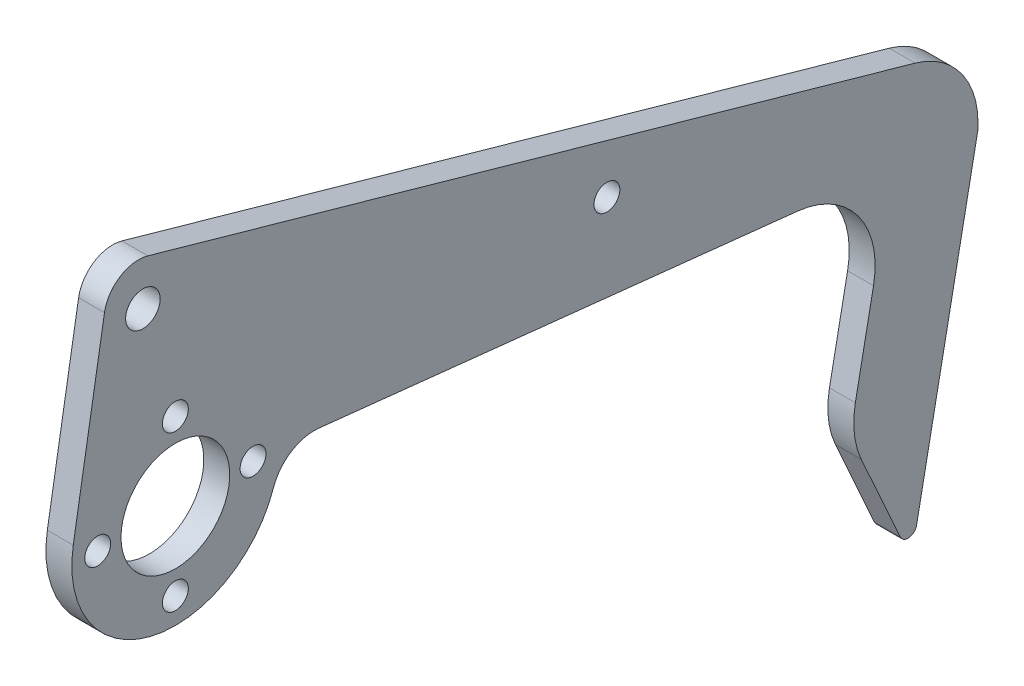
ISO-10303-21;
HEADER;
FILE_DESCRIPTION(('STEP AP214'),'2;1');
FILE_NAME('part.step','',(''),(''),'','','');
FILE_SCHEMA(('AUTOMOTIVE_DESIGN { 1 0 10303 214 1 1 1 1 }'));
ENDSEC;
DATA;
#1=APPLICATION_CONTEXT('core data for automotive mechanical design processes');
#2=APPLICATION_PROTOCOL_DEFINITION('international standard','automotive_design',2000,#1);
#3=PRODUCT_CONTEXT('',#1,'mechanical');
#4=PRODUCT('Part','Part','',(#3));
#5=PRODUCT_RELATED_PRODUCT_CATEGORY('part','',(#4));
#6=PRODUCT_DEFINITION_FORMATION('','',#4);
#7=PRODUCT_DEFINITION_CONTEXT('part definition',#1,'design');
#8=PRODUCT_DEFINITION('design','',#6,#7);
#9=PRODUCT_DEFINITION_SHAPE('','',#8);
#10=(LENGTH_UNIT() NAMED_UNIT(*) SI_UNIT(.MILLI.,.METRE.));
#11=(NAMED_UNIT(*) PLANE_ANGLE_UNIT() SI_UNIT($,.RADIAN.));
#12=(NAMED_UNIT(*) SI_UNIT($,.STERADIAN.) SOLID_ANGLE_UNIT());
#13=UNCERTAINTY_MEASURE_WITH_UNIT(LENGTH_MEASURE(1.E-05),#10,'distance_accuracy_value','');
#14=(GEOMETRIC_REPRESENTATION_CONTEXT(3) GLOBAL_UNCERTAINTY_ASSIGNED_CONTEXT((#13)) GLOBAL_UNIT_ASSIGNED_CONTEXT((#10,
#11,#12)) REPRESENTATION_CONTEXT('',''));
#15=CARTESIAN_POINT('',(0.,0.,0.));
#16=DIRECTION('',(0.,0.,1.));
#17=DIRECTION('',(1.,0.,0.));
#18=AXIS2_PLACEMENT_3D('',#15,#16,#17);
#19=CARTESIAN_POINT('',(3.,0.,0.));
#20=DIRECTION('',(-1.,0.,0.));
#21=DIRECTION('',(0.,0.,-1.));
#22=AXIS2_PLACEMENT_3D('',#19,#20,#21);
#23=CYLINDRICAL_SURFACE('',#22,12.);
#24=CARTESIAN_POINT('',(3.,0.,0.));
#25=DIRECTION('',(-1.,0.,0.));
#26=DIRECTION('',(0.,0.,1.));
#27=AXIS2_PLACEMENT_3D('',#24,#25,#26);
#28=CIRCLE('',#27,12.);
#29=CARTESIAN_POINT('',(3.,-3.86044776965129,-11.3620835685095));
#30=VERTEX_POINT('',#29);
#31=CARTESIAN_POINT('',(3.,1.99138832062666,11.8336119826734));
#32=VERTEX_POINT('',#31);
#33=EDGE_CURVE('E205',#30,#32,#28,.T.);
#34=ORIENTED_EDGE('',*,*,#33,.T.);
#35=DIRECTION('',(1.,0.,0.));
#36=VECTOR('',#35,1.);
#37=CARTESIAN_POINT('',(0.,1.99138832062666,11.8336119826734));
#38=LINE('',#37,#36);
#39=CARTESIAN_POINT('',(0.,1.99138832062666,11.8336119826734));
#40=VERTEX_POINT('',#39);
#41=EDGE_CURVE('E203',#40,#32,#38,.T.);
#42=ORIENTED_EDGE('',*,*,#41,.F.);
#43=CARTESIAN_POINT('',(0.,0.,0.));
#44=DIRECTION('',(-1.,0.,0.));
#45=DIRECTION('',(0.,0.,1.));
#46=AXIS2_PLACEMENT_3D('',#43,#44,#45);
#47=CIRCLE('',#46,12.);
#48=CARTESIAN_POINT('',(0.,-3.86044776965129,-11.3620835685095));
#49=VERTEX_POINT('',#48);
#50=EDGE_CURVE('E201',#49,#40,#47,.T.);
#51=ORIENTED_EDGE('',*,*,#50,.F.);
#52=DIRECTION('',(-1.,0.,0.));
#53=VECTOR('',#52,1.);
#54=CARTESIAN_POINT('',(3.,-3.86044776965129,-11.3620835685095));
#55=LINE('',#54,#53);
#56=EDGE_CURVE('E195',#30,#49,#55,.T.);
#57=ORIENTED_EDGE('',*,*,#56,.F.);
#58=EDGE_LOOP('',(#34,#42,#51,#57));
#59=FACE_BOUND('',#58,.T.);
#60=ADVANCED_FACE('F39',(#59),#23,.T.);
#61=CARTESIAN_POINT('',(3.,0.,0.));
#62=DIRECTION('',(1.,0.,0.));
#63=DIRECTION('',(0.,0.,1.));
#64=AXIS2_PLACEMENT_3D('',#61,#62,#63);
#65=PLANE('',#64);
#66=DIRECTION('',(0.,0.981180262311398,-0.19309400003764));
#67=VECTOR('',#66,1.);
#68=CARTESIAN_POINT('',(3.,-8.70416584597603,-93.));
#69=LINE('',#68,#67);
#70=CARTESIAN_POINT('',(3.,-44.8725053736254,-85.8821546637504));
#71=VERTEX_POINT('',#70);
#72=CARTESIAN_POINT('',(3.,-8.70416584597603,-93.));
#73=VERTEX_POINT('',#72);
#74=EDGE_CURVE('E248',#71,#73,#69,.T.);
#75=ORIENTED_EDGE('',*,*,#74,.T.);
#76=DIRECTION('',(0.,1.,0.));
#77=VECTOR('',#76,1.);
#78=CARTESIAN_POINT('',(3.,-8.70416584597603,-93.));
#79=LINE('',#78,#77);
#80=CARTESIAN_POINT('',(3.,-8.03590102239973,-93.));
#81=VERTEX_POINT('',#80);
#82=EDGE_CURVE('E163',#73,#81,#79,.T.);
#83=ORIENTED_EDGE('',*,*,#82,.T.);
#84=CARTESIAN_POINT('',(3.,-8.03590102239973,-83.));
#85=DIRECTION('',(-1.,0.,0.));
#86=DIRECTION('',(0.,0.,1.));
#87=AXIS2_PLACEMENT_3D('',#84,#85,#86);
#88=CIRCLE('',#87,10.);
#89=CARTESIAN_POINT('',(3.,1.58758729883579,-85.7181744850255));
#90=VERTEX_POINT('',#89);
#91=EDGE_CURVE('E143',#90,#81,#88,.T.);
#92=ORIENTED_EDGE('',*,*,#91,.F.);
#93=DIRECTION('',(0.,0.271817448502551,0.962348832123551));
#94=VECTOR('',#93,1.);
#95=CARTESIAN_POINT('',(3.,23.892723580228,-6.7485499483835));
#96=LINE('',#95,#94);
#97=CARTESIAN_POINT('',(3.,26.6971591930867,3.18033928101759));
#98=VERTEX_POINT('',#97);
#99=EDGE_CURVE('E151',#90,#98,#96,.T.);
#100=ORIENTED_EDGE('',*,*,#99,.T.);
#101=CARTESIAN_POINT('',(3.,22.8477638645925,4.2676090750278));
#102=DIRECTION('',(-1.,0.,0.));
#103=DIRECTION('',(0.,0.,1.));
#104=AXIS2_PLACEMENT_3D('',#101,#102,#103);
#105=CIRCLE('',#104,4.);
#106=CARTESIAN_POINT('',(3.,23.5115599714681,8.2121464025856));
#107=VERTEX_POINT('',#106);
#108=EDGE_CURVE('E271',#107,#98,#105,.T.);
#109=ORIENTED_EDGE('',*,*,#108,.F.);
#110=DIRECTION('',(0.,0.986134331889451,-0.165949026718888));
#111=VECTOR('',#110,1.);
#112=CARTESIAN_POINT('',(3.,1.99138832062666,11.8336119826734));
#113=LINE('',#112,#111);
#114=EDGE_CURVE('E265',#32,#107,#113,.T.);
#115=ORIENTED_EDGE('',*,*,#114,.F.);
#116=ORIENTED_EDGE('',*,*,#33,.F.);
#117=CARTESIAN_POINT('',(3.,-5.46896767367267,-16.0962850553885));
#118=DIRECTION('',(-1.,0.,0.));
#119=DIRECTION('',(0.,0.,1.));
#120=AXIS2_PLACEMENT_3D('',#117,#118,#119);
#121=CIRCLE('',#120,5.);
#122=CARTESIAN_POINT('',(3.,-0.497588542771267,-16.6305036780872));
#123=VERTEX_POINT('',#122);
#124=EDGE_CURVE('E47',#123,#30,#121,.F.);
#125=ORIENTED_EDGE('',*,*,#124,.F.);
#126=DIRECTION('',(0.,-0.106843724539728,-0.99427582618028));
#127=VECTOR('',#126,1.);
#128=CARTESIAN_POINT('',(3.,1.274785589867,-0.136986977682256));
#129=LINE('',#128,#127);
#130=CARTESIAN_POINT('',(3.,-6.46358282116851,-72.1493833848179));
#131=VERTEX_POINT('',#130);
#132=EDGE_CURVE('E257',#123,#131,#129,.T.);
#133=ORIENTED_EDGE('',*,*,#132,.T.);
#134=CARTESIAN_POINT('',(3.,-16.4063410829713,-71.0809461394205));
#135=DIRECTION('',(-1.,0.,0.));
#136=DIRECTION('',(0.,0.,1.));
#137=AXIS2_PLACEMENT_3D('',#134,#135,#136);
#138=CIRCLE('',#137,10.);
#139=CARTESIAN_POINT('',(3.,-18.3372810833477,-80.8927487625345));
#140=VERTEX_POINT('',#139);
#141=EDGE_CURVE('E180',#140,#131,#138,.F.);
#142=ORIENTED_EDGE('',*,*,#141,.F.);
#143=DIRECTION('',(0.,-0.981180262311398,0.19309400003764));
#144=VECTOR('',#143,1.);
#145=CARTESIAN_POINT('',(3.,-32.1590840277146,-78.172649999059));
#146=LINE('',#145,#144);
#147=CARTESIAN_POINT('',(3.,-29.0322407200414,-78.7880055101322));
#148=VERTEX_POINT('',#147);
#149=EDGE_CURVE('E240',#140,#148,#146,.T.);
#150=ORIENTED_EDGE('',*,*,#149,.T.);
#151=CARTESIAN_POINT('',(3.,-30.9631807204178,-88.5998081332462));
#152=DIRECTION('',(-1.,0.,0.));
#153=DIRECTION('',(0.,0.,1.));
#154=AXIS2_PLACEMENT_3D('',#151,#152,#153);
#155=CIRCLE('',#154,10.);
#156=CARTESIAN_POINT('',(3.,-35.0654148019241,-79.479957501765));
#157=VERTEX_POINT('',#156);
#158=EDGE_CURVE('E164',#157,#148,#155,.T.);
#159=ORIENTED_EDGE('',*,*,#158,.F.);
#160=DIRECTION('',(0.,-0.911985063148122,-0.410223408150628));
#161=VECTOR('',#160,1.);
#162=CARTESIAN_POINT('',(3.,-47.951376338432,-85.2762399984944));
#163=LINE('',#162,#161);
#164=CARTESIAN_POINT('',(3.,-45.0896347817384,-83.9889893382909));
#165=VERTEX_POINT('',#164);
#166=EDGE_CURVE('E247',#157,#165,#163,.T.);
#167=ORIENTED_EDGE('',*,*,#166,.T.);
#168=CARTESIAN_POINT('',(3.,-44.6794113735878,-84.9009744014391));
#169=DIRECTION('',(-1.,0.,0.));
#170=DIRECTION('',(0.,0.,1.));
#171=AXIS2_PLACEMENT_3D('',#168,#169,#170);
#172=CIRCLE('',#171,1.);
#173=EDGE_CURVE('E190',#71,#165,#172,.T.);
#174=ORIENTED_EDGE('',*,*,#173,.F.);
#175=EDGE_LOOP('',(#75,#83,#92,#100,#109,#115,#116,#125,#133,#142,#150,#159,#167,#174));
#176=FACE_BOUND('',#175,.T.);
#177=CARTESIAN_POINT('',(3.,6.,-50.));
#178=DIRECTION('',(1.,0.,0.));
#179=DIRECTION('',(0.,0.,-1.));
#180=AXIS2_PLACEMENT_3D('',#177,#178,#179);
#181=CIRCLE('',#180,1.5);
#182=CARTESIAN_POINT('',(3.,6.,-51.5));
#183=VERTEX_POINT('',#182);
#184=EDGE_CURVE('E281',#183,#183,#181,.T.);
#185=ORIENTED_EDGE('',*,*,#184,.F.);
#186=EDGE_LOOP('',(#185));
#187=FACE_BOUND('',#186,.T.);
#188=CARTESIAN_POINT('',(3.,-9.,0.));
#189=DIRECTION('',(-1.,0.,0.));
#190=DIRECTION('',(0.,0.,1.));
#191=AXIS2_PLACEMENT_3D('',#188,#189,#190);
#192=CIRCLE('',#191,1.5);
#193=CARTESIAN_POINT('',(3.,-9.,1.5));
#194=VERTEX_POINT('',#193);
#195=EDGE_CURVE('E293',#194,#194,#192,.T.);
#196=ORIENTED_EDGE('',*,*,#195,.T.);
#197=EDGE_LOOP('',(#196));
#198=FACE_BOUND('',#197,.T.);
#199=CARTESIAN_POINT('',(3.,0.,0.));
#200=DIRECTION('',(-1.,0.,0.));
#201=DIRECTION('',(0.,0.,1.));
#202=AXIS2_PLACEMENT_3D('',#199,#200,#201);
#203=CIRCLE('',#202,6.3);
#204=CARTESIAN_POINT('',(3.,0.,6.3));
#205=VERTEX_POINT('',#204);
#206=EDGE_CURVE('E305',#205,#205,#203,.T.);
#207=ORIENTED_EDGE('',*,*,#206,.T.);
#208=EDGE_LOOP('',(#207));
#209=FACE_BOUND('',#208,.T.);
#210=CARTESIAN_POINT('',(3.,9.,0.));
#211=DIRECTION('',(-1.,0.,0.));
#212=DIRECTION('',(0.,0.,1.));
#213=AXIS2_PLACEMENT_3D('',#210,#211,#212);
#214=CIRCLE('',#213,1.5);
#215=CARTESIAN_POINT('',(3.,9.,1.5));
#216=VERTEX_POINT('',#215);
#217=EDGE_CURVE('E206',#216,#216,#214,.T.);
#218=ORIENTED_EDGE('',*,*,#217,.T.);
#219=EDGE_LOOP('',(#218));
#220=FACE_BOUND('',#219,.T.);
#221=CARTESIAN_POINT('',(3.,0.,9.));
#222=DIRECTION('',(-1.,0.,0.));
#223=DIRECTION('',(0.,0.,1.));
#224=AXIS2_PLACEMENT_3D('',#221,#222,#223);
#225=CIRCLE('',#224,1.5);
#226=CARTESIAN_POINT('',(3.,0.,10.5));
#227=VERTEX_POINT('',#226);
#228=EDGE_CURVE('E299',#227,#227,#225,.T.);
#229=ORIENTED_EDGE('',*,*,#228,.T.);
#230=EDGE_LOOP('',(#229));
#231=FACE_BOUND('',#230,.T.);
#232=CARTESIAN_POINT('',(3.,0.,-9.));
#233=DIRECTION('',(-1.,0.,0.));
#234=DIRECTION('',(0.,0.,1.));
#235=AXIS2_PLACEMENT_3D('',#232,#233,#234);
#236=CIRCLE('',#235,1.5);
#237=CARTESIAN_POINT('',(3.,0.,-7.5));
#238=VERTEX_POINT('',#237);
#239=EDGE_CURVE('E287',#238,#238,#236,.T.);
#240=ORIENTED_EDGE('',*,*,#239,.T.);
#241=EDGE_LOOP('',(#240));
#242=FACE_BOUND('',#241,.T.);
#243=CARTESIAN_POINT('',(3.,21.6761722371468,3.76079209017824));
#244=DIRECTION('',(-1.,0.,0.));
#245=DIRECTION('',(0.,0.,1.));
#246=AXIS2_PLACEMENT_3D('',#243,#244,#245);
#247=CIRCLE('',#246,2.);
#248=CARTESIAN_POINT('',(3.,21.6761722371468,5.76079209017824));
#249=VERTEX_POINT('',#248);
#250=EDGE_CURVE('E261',#249,#249,#247,.T.);
#251=ORIENTED_EDGE('',*,*,#250,.T.);
#252=EDGE_LOOP('',(#251));
#253=FACE_BOUND('',#252,.T.);
#254=ADVANCED_FACE('F160',(#176,#187,#198,#209,#220,#231,#242,#253),#65,.T.);
#255=CARTESIAN_POINT('',(0.,0.,0.));
#256=DIRECTION('',(1.,0.,0.));
#257=DIRECTION('',(0.,0.,1.));
#258=AXIS2_PLACEMENT_3D('',#255,#256,#257);
#259=PLANE('',#258);
#260=DIRECTION('',(0.,-0.271817448502551,-0.962348832123551));
#261=VECTOR('',#260,1.);
#262=CARTESIAN_POINT('',(0.,23.892723580228,-6.7485499483835));
#263=LINE('',#262,#261);
#264=CARTESIAN_POINT('',(0.,26.6971591930867,3.1803392810176));
#265=VERTEX_POINT('',#264);
#266=CARTESIAN_POINT('',(0.,1.58758729883578,-85.7181744850255));
#267=VERTEX_POINT('',#266);
#268=EDGE_CURVE('E242',#265,#267,#263,.T.);
#269=ORIENTED_EDGE('',*,*,#268,.T.);
#270=CARTESIAN_POINT('',(0.,-8.03590102239973,-83.));
#271=DIRECTION('',(-1.,0.,0.));
#272=DIRECTION('',(0.,0.,1.));
#273=AXIS2_PLACEMENT_3D('',#270,#271,#272);
#274=CIRCLE('',#273,10.);
#275=CARTESIAN_POINT('',(0.,-8.03590102239973,-93.));
#276=VERTEX_POINT('',#275);
#277=EDGE_CURVE('E146',#276,#267,#274,.F.);
#278=ORIENTED_EDGE('',*,*,#277,.F.);
#279=DIRECTION('',(0.,1.,0.));
#280=VECTOR('',#279,1.);
#281=CARTESIAN_POINT('',(0.,-8.70416584597603,-93.));
#282=LINE('',#281,#280);
#283=CARTESIAN_POINT('',(0.,-8.70416584597603,-93.));
#284=VERTEX_POINT('',#283);
#285=EDGE_CURVE('E250',#284,#276,#282,.T.);
#286=ORIENTED_EDGE('',*,*,#285,.F.);
#287=DIRECTION('',(0.,0.981180262311398,-0.19309400003764));
#288=VECTOR('',#287,1.);
#289=CARTESIAN_POINT('',(0.,-8.70416584597603,-93.));
#290=LINE('',#289,#288);
#291=CARTESIAN_POINT('',(0.,-44.8725053736254,-85.8821546637504));
#292=VERTEX_POINT('',#291);
#293=EDGE_CURVE('E236',#292,#284,#290,.T.);
#294=ORIENTED_EDGE('',*,*,#293,.F.);
#295=CARTESIAN_POINT('',(0.,-44.6794113735878,-84.9009744014391));
#296=DIRECTION('',(-1.,0.,0.));
#297=DIRECTION('',(0.,0.,1.));
#298=AXIS2_PLACEMENT_3D('',#295,#296,#297);
#299=CIRCLE('',#298,1.);
#300=CARTESIAN_POINT('',(0.,-45.0896347817384,-83.9889893382909));
#301=VERTEX_POINT('',#300);
#302=EDGE_CURVE('E185',#301,#292,#299,.F.);
#303=ORIENTED_EDGE('',*,*,#302,.F.);
#304=DIRECTION('',(0.,-0.911985063148122,-0.410223408150628));
#305=VECTOR('',#304,1.);
#306=CARTESIAN_POINT('',(0.,-47.951376338432,-85.2762399984944));
#307=LINE('',#306,#305);
#308=CARTESIAN_POINT('',(0.,-35.0654148019241,-79.479957501765));
#309=VERTEX_POINT('',#308);
#310=EDGE_CURVE('E231',#309,#301,#307,.T.);
#311=ORIENTED_EDGE('',*,*,#310,.F.);
#312=CARTESIAN_POINT('',(0.,-30.9631807204178,-88.5998081332462));
#313=DIRECTION('',(-1.,0.,0.));
#314=DIRECTION('',(0.,0.,1.));
#315=AXIS2_PLACEMENT_3D('',#312,#313,#314);
#316=CIRCLE('',#315,10.);
#317=CARTESIAN_POINT('',(0.,-29.0322407200414,-78.7880055101322));
#318=VERTEX_POINT('',#317);
#319=EDGE_CURVE('E170',#318,#309,#316,.F.);
#320=ORIENTED_EDGE('',*,*,#319,.F.);
#321=DIRECTION('',(0.,-0.981180262311398,0.19309400003764));
#322=VECTOR('',#321,1.);
#323=CARTESIAN_POINT('',(0.,-32.1590840277146,-78.172649999059));
#324=LINE('',#323,#322);
#325=CARTESIAN_POINT('',(0.,-18.3372810833477,-80.8927487625345));
#326=VERTEX_POINT('',#325);
#327=EDGE_CURVE('E237',#326,#318,#324,.T.);
#328=ORIENTED_EDGE('',*,*,#327,.F.);
#329=CARTESIAN_POINT('',(0.,-16.4063410829713,-71.0809461394205));
#330=DIRECTION('',(-1.,0.,0.));
#331=DIRECTION('',(0.,0.,1.));
#332=AXIS2_PLACEMENT_3D('',#329,#330,#331);
#333=CIRCLE('',#332,10.);
#334=CARTESIAN_POINT('',(0.,-6.46358282116851,-72.1493833848178));
#335=VERTEX_POINT('',#334);
#336=EDGE_CURVE('E177',#335,#326,#333,.T.);
#337=ORIENTED_EDGE('',*,*,#336,.F.);
#338=DIRECTION('',(0.,-0.106843724539728,-0.99427582618028));
#339=VECTOR('',#338,1.);
#340=CARTESIAN_POINT('',(0.,1.274785589867,-0.136986977682256));
#341=LINE('',#340,#339);
#342=CARTESIAN_POINT('',(0.,-0.497588542771267,-16.6305036780872));
#343=VERTEX_POINT('',#342);
#344=EDGE_CURVE('E208',#343,#335,#341,.T.);
#345=ORIENTED_EDGE('',*,*,#344,.F.);
#346=CARTESIAN_POINT('',(0.,-5.46896767367267,-16.0962850553885));
#347=DIRECTION('',(-1.,0.,0.));
#348=DIRECTION('',(0.,0.,1.));
#349=AXIS2_PLACEMENT_3D('',#346,#347,#348);
#350=CIRCLE('',#349,5.);
#351=EDGE_CURVE('E11',#49,#343,#350,.T.);
#352=ORIENTED_EDGE('',*,*,#351,.F.);
#353=ORIENTED_EDGE('',*,*,#50,.T.);
#354=DIRECTION('',(0.,0.986134331889451,-0.165949026718888));
#355=VECTOR('',#354,1.);
#356=CARTESIAN_POINT('',(0.,1.99138832062666,11.8336119826734));
#357=LINE('',#356,#355);
#358=CARTESIAN_POINT('',(0.,23.5115599714681,8.2121464025856));
#359=VERTEX_POINT('',#358);
#360=EDGE_CURVE('E268',#40,#359,#357,.T.);
#361=ORIENTED_EDGE('',*,*,#360,.T.);
#362=CARTESIAN_POINT('',(0.,22.8477638645925,4.2676090750278));
#363=DIRECTION('',(-1.,0.,0.));
#364=DIRECTION('',(0.,0.,1.));
#365=AXIS2_PLACEMENT_3D('',#362,#363,#364);
#366=CIRCLE('',#365,4.);
#367=EDGE_CURVE('E270',#359,#265,#366,.T.);
#368=ORIENTED_EDGE('',*,*,#367,.T.);
#369=EDGE_LOOP('',(#269,#278,#286,#294,#303,#311,#320,#328,#337,#345,#352,#353,#361,#368));
#370=FACE_BOUND('',#369,.T.);
#371=CARTESIAN_POINT('',(0.,6.,-50.));
#372=DIRECTION('',(1.,0.,0.));
#373=DIRECTION('',(0.,0.,-1.));
#374=AXIS2_PLACEMENT_3D('',#371,#372,#373);
#375=CIRCLE('',#374,1.5);
#376=CARTESIAN_POINT('',(0.,6.,-51.5));
#377=VERTEX_POINT('',#376);
#378=EDGE_CURVE('E279',#377,#377,#375,.T.);
#379=ORIENTED_EDGE('',*,*,#378,.T.);
#380=EDGE_LOOP('',(#379));
#381=FACE_BOUND('',#380,.T.);
#382=CARTESIAN_POINT('',(0.,9.,0.));
#383=DIRECTION('',(-1.,0.,0.));
#384=DIRECTION('',(0.,0.,1.));
#385=AXIS2_PLACEMENT_3D('',#382,#383,#384);
#386=CIRCLE('',#385,1.5);
#387=CARTESIAN_POINT('',(0.,9.,1.5));
#388=VERTEX_POINT('',#387);
#389=EDGE_CURVE('E211',#388,#388,#386,.T.);
#390=ORIENTED_EDGE('',*,*,#389,.F.);
#391=EDGE_LOOP('',(#390));
#392=FACE_BOUND('',#391,.T.);
#393=CARTESIAN_POINT('',(0.,0.,0.));
#394=DIRECTION('',(-1.,0.,0.));
#395=DIRECTION('',(0.,0.,1.));
#396=AXIS2_PLACEMENT_3D('',#393,#394,#395);
#397=CIRCLE('',#396,6.3);
#398=CARTESIAN_POINT('',(0.,0.,6.3));
#399=VERTEX_POINT('',#398);
#400=EDGE_CURVE('E302',#399,#399,#397,.T.);
#401=ORIENTED_EDGE('',*,*,#400,.F.);
#402=EDGE_LOOP('',(#401));
#403=FACE_BOUND('',#402,.T.);
#404=CARTESIAN_POINT('',(0.,0.,9.));
#405=DIRECTION('',(-1.,0.,0.));
#406=DIRECTION('',(0.,0.,1.));
#407=AXIS2_PLACEMENT_3D('',#404,#405,#406);
#408=CIRCLE('',#407,1.5);
#409=CARTESIAN_POINT('',(0.,0.,10.5));
#410=VERTEX_POINT('',#409);
#411=EDGE_CURVE('E296',#410,#410,#408,.T.);
#412=ORIENTED_EDGE('',*,*,#411,.F.);
#413=EDGE_LOOP('',(#412));
#414=FACE_BOUND('',#413,.T.);
#415=CARTESIAN_POINT('',(0.,-9.,0.));
#416=DIRECTION('',(-1.,0.,0.));
#417=DIRECTION('',(0.,0.,1.));
#418=AXIS2_PLACEMENT_3D('',#415,#416,#417);
#419=CIRCLE('',#418,1.5);
#420=CARTESIAN_POINT('',(0.,-9.,1.5));
#421=VERTEX_POINT('',#420);
#422=EDGE_CURVE('E290',#421,#421,#419,.T.);
#423=ORIENTED_EDGE('',*,*,#422,.F.);
#424=EDGE_LOOP('',(#423));
#425=FACE_BOUND('',#424,.T.);
#426=CARTESIAN_POINT('',(0.,0.,-9.));
#427=DIRECTION('',(-1.,0.,0.));
#428=DIRECTION('',(0.,0.,1.));
#429=AXIS2_PLACEMENT_3D('',#426,#427,#428);
#430=CIRCLE('',#429,1.5);
#431=CARTESIAN_POINT('',(0.,0.,-7.5));
#432=VERTEX_POINT('',#431);
#433=EDGE_CURVE('E284',#432,#432,#430,.T.);
#434=ORIENTED_EDGE('',*,*,#433,.F.);
#435=EDGE_LOOP('',(#434));
#436=FACE_BOUND('',#435,.T.);
#437=CARTESIAN_POINT('',(0.,21.6761722371468,3.76079209017824));
#438=DIRECTION('',(-1.,0.,0.));
#439=DIRECTION('',(0.,0.,1.));
#440=AXIS2_PLACEMENT_3D('',#437,#438,#439);
#441=CIRCLE('',#440,2.);
#442=CARTESIAN_POINT('',(0.,21.6761722371468,5.76079209017824));
#443=VERTEX_POINT('',#442);
#444=EDGE_CURVE('E262',#443,#443,#441,.T.);
#445=ORIENTED_EDGE('',*,*,#444,.F.);
#446=EDGE_LOOP('',(#445));
#447=FACE_BOUND('',#446,.T.);
#448=ADVANCED_FACE('F232',(#370,#381,#392,#403,#414,#425,#436,#447),#259,.F.);
#449=CARTESIAN_POINT('',(3.,9.,0.));
#450=DIRECTION('',(-1.,0.,0.));
#451=DIRECTION('',(0.,0.,-1.));
#452=AXIS2_PLACEMENT_3D('',#449,#450,#451);
#453=CYLINDRICAL_SURFACE('',#452,1.5);
#454=ORIENTED_EDGE('',*,*,#217,.F.);
#455=EDGE_LOOP('',(#454));
#456=FACE_BOUND('',#455,.T.);
#457=ORIENTED_EDGE('',*,*,#389,.T.);
#458=EDGE_LOOP('',(#457));
#459=FACE_BOUND('',#458,.T.);
#460=ADVANCED_FACE('F312',(#456,#459),#453,.F.);
#461=CARTESIAN_POINT('',(3.,0.,0.));
#462=DIRECTION('',(-1.,0.,0.));
#463=DIRECTION('',(0.,0.,-1.));
#464=AXIS2_PLACEMENT_3D('',#461,#462,#463);
#465=CYLINDRICAL_SURFACE('',#464,6.3);
#466=ORIENTED_EDGE('',*,*,#206,.F.);
#467=EDGE_LOOP('',(#466));
#468=FACE_BOUND('',#467,.T.);
#469=ORIENTED_EDGE('',*,*,#400,.T.);
#470=EDGE_LOOP('',(#469));
#471=FACE_BOUND('',#470,.T.);
#472=ADVANCED_FACE('F403',(#468,#471),#465,.F.);
#473=CARTESIAN_POINT('',(3.,0.,9.));
#474=DIRECTION('',(-1.,0.,0.));
#475=DIRECTION('',(0.,0.,-1.));
#476=AXIS2_PLACEMENT_3D('',#473,#474,#475);
#477=CYLINDRICAL_SURFACE('',#476,1.5);
#478=ORIENTED_EDGE('',*,*,#228,.F.);
#479=EDGE_LOOP('',(#478));
#480=FACE_BOUND('',#479,.T.);
#481=ORIENTED_EDGE('',*,*,#411,.T.);
#482=EDGE_LOOP('',(#481));
#483=FACE_BOUND('',#482,.T.);
#484=ADVANCED_FACE('F400',(#480,#483),#477,.F.);
#485=CARTESIAN_POINT('',(3.,-9.,0.));
#486=DIRECTION('',(-1.,0.,0.));
#487=DIRECTION('',(0.,0.,-1.));
#488=AXIS2_PLACEMENT_3D('',#485,#486,#487);
#489=CYLINDRICAL_SURFACE('',#488,1.5);
#490=ORIENTED_EDGE('',*,*,#195,.F.);
#491=EDGE_LOOP('',(#490));
#492=FACE_BOUND('',#491,.T.);
#493=ORIENTED_EDGE('',*,*,#422,.T.);
#494=EDGE_LOOP('',(#493));
#495=FACE_BOUND('',#494,.T.);
#496=ADVANCED_FACE('F396',(#492,#495),#489,.F.);
#497=CARTESIAN_POINT('',(3.,0.,-9.));
#498=DIRECTION('',(-1.,0.,0.));
#499=DIRECTION('',(0.,0.,-1.));
#500=AXIS2_PLACEMENT_3D('',#497,#498,#499);
#501=CYLINDRICAL_SURFACE('',#500,1.5);
#502=ORIENTED_EDGE('',*,*,#239,.F.);
#503=EDGE_LOOP('',(#502));
#504=FACE_BOUND('',#503,.T.);
#505=ORIENTED_EDGE('',*,*,#433,.T.);
#506=EDGE_LOOP('',(#505));
#507=FACE_BOUND('',#506,.T.);
#508=ADVANCED_FACE('F392',(#504,#507),#501,.F.);
#509=CARTESIAN_POINT('',(3.,6.,-50.));
#510=DIRECTION('',(-1.,0.,0.));
#511=DIRECTION('',(0.,0.,-1.));
#512=AXIS2_PLACEMENT_3D('',#509,#510,#511);
#513=CYLINDRICAL_SURFACE('',#512,1.5);
#514=ORIENTED_EDGE('',*,*,#184,.T.);
#515=EDGE_LOOP('',(#514));
#516=FACE_BOUND('',#515,.T.);
#517=ORIENTED_EDGE('',*,*,#378,.F.);
#518=EDGE_LOOP('',(#517));
#519=FACE_BOUND('',#518,.T.);
#520=ADVANCED_FACE('F385',(#516,#519),#513,.F.);
#521=CARTESIAN_POINT('',(0.,22.8477638645925,4.2676090750278));
#522=DIRECTION('',(1.,0.,0.));
#523=DIRECTION('',(0.,0.,1.));
#524=AXIS2_PLACEMENT_3D('',#521,#522,#523);
#525=CYLINDRICAL_SURFACE('',#524,4.);
#526=DIRECTION('',(1.,0.,0.));
#527=VECTOR('',#526,1.);
#528=CARTESIAN_POINT('',(-92.3766006655577,26.6971591930867,3.18033928101759));
#529=LINE('',#528,#527);
#530=EDGE_CURVE('E150',#265,#98,#529,.T.);
#531=ORIENTED_EDGE('',*,*,#530,.F.);
#532=ORIENTED_EDGE('',*,*,#367,.F.);
#533=DIRECTION('',(1.,0.,0.));
#534=VECTOR('',#533,1.);
#535=CARTESIAN_POINT('',(0.,23.5115599714681,8.2121464025856));
#536=LINE('',#535,#534);
#537=EDGE_CURVE('E277',#359,#107,#536,.T.);
#538=ORIENTED_EDGE('',*,*,#537,.T.);
#539=ORIENTED_EDGE('',*,*,#108,.T.);
#540=EDGE_LOOP('',(#531,#532,#538,#539));
#541=FACE_BOUND('',#540,.T.);
#542=ADVANCED_FACE('F382',(#541),#525,.T.);
#543=CARTESIAN_POINT('',(0.,1.99138832062666,11.8336119826734));
#544=DIRECTION('',(0.,0.165949026718888,0.986134331889451));
#545=DIRECTION('',(0.,0.986134331889451,-0.165949026718888));
#546=AXIS2_PLACEMENT_3D('',#543,#544,#545);
#547=PLANE('',#546);
#548=ORIENTED_EDGE('',*,*,#114,.T.);
#549=ORIENTED_EDGE('',*,*,#537,.F.);
#550=ORIENTED_EDGE('',*,*,#360,.F.);
#551=ORIENTED_EDGE('',*,*,#41,.T.);
#552=EDGE_LOOP('',(#548,#549,#550,#551));
#553=FACE_BOUND('',#552,.T.);
#554=ADVANCED_FACE('F331',(#553),#547,.T.);
#555=CARTESIAN_POINT('',(0.,21.6761722371468,3.76079209017824));
#556=DIRECTION('',(1.,0.,0.));
#557=DIRECTION('',(0.,0.,1.));
#558=AXIS2_PLACEMENT_3D('',#555,#556,#557);
#559=CYLINDRICAL_SURFACE('',#558,2.);
#560=ORIENTED_EDGE('',*,*,#444,.T.);
#561=EDGE_LOOP('',(#560));
#562=FACE_BOUND('',#561,.T.);
#563=ORIENTED_EDGE('',*,*,#250,.F.);
#564=EDGE_LOOP('',(#563));
#565=FACE_BOUND('',#564,.T.);
#566=ADVANCED_FACE('F327',(#562,#565),#559,.F.);
#567=CARTESIAN_POINT('',(-7.,1.274785589867,-0.136986977682256));
#568=DIRECTION('',(0.,0.99427582618028,-0.106843724539728));
#569=DIRECTION('',(0.,-0.106843724539728,-0.99427582618028));
#570=AXIS2_PLACEMENT_3D('',#567,#568,#569);
#571=PLANE('',#570);
#572=ORIENTED_EDGE('',*,*,#344,.T.);
#573=DIRECTION('',(-1.,0.,0.));
#574=VECTOR('',#573,1.);
#575=CARTESIAN_POINT('',(-7.,-6.46358282116851,-72.1493833848178));
#576=LINE('',#575,#574);
#577=EDGE_CURVE('E175',#131,#335,#576,.T.);
#578=ORIENTED_EDGE('',*,*,#577,.F.);
#579=ORIENTED_EDGE('',*,*,#132,.F.);
#580=DIRECTION('',(1.,0.,0.));
#581=VECTOR('',#580,1.);
#582=CARTESIAN_POINT('',(3.,-0.497588542771265,-16.6305036780872));
#583=LINE('',#582,#581);
#584=EDGE_CURVE('E193',#343,#123,#583,.T.);
#585=ORIENTED_EDGE('',*,*,#584,.F.);
#586=EDGE_LOOP('',(#572,#578,#579,#585));
#587=FACE_BOUND('',#586,.T.);
#588=ADVANCED_FACE('F330',(#587),#571,.F.);
#589=CARTESIAN_POINT('',(22.0259690462828,-8.70416584597603,-93.));
#590=DIRECTION('',(0.,0.,-1.));
#591=DIRECTION('',(1.,0.,0.));
#592=AXIS2_PLACEMENT_3D('',#589,#590,#591);
#593=PLANE('',#592);
#594=ORIENTED_EDGE('',*,*,#82,.F.);
#595=DIRECTION('',(-1.,0.,0.));
#596=VECTOR('',#595,1.);
#597=CARTESIAN_POINT('',(22.0259690462828,-8.70416584597603,-93.));
#598=LINE('',#597,#596);
#599=EDGE_CURVE('E255',#73,#284,#598,.T.);
#600=ORIENTED_EDGE('',*,*,#599,.T.);
#601=ORIENTED_EDGE('',*,*,#285,.T.);
#602=DIRECTION('',(-1.,0.,0.));
#603=VECTOR('',#602,1.);
#604=CARTESIAN_POINT('',(22.0259690462828,-8.03590102239973,-93.));
#605=LINE('',#604,#603);
#606=EDGE_CURVE('E168',#81,#276,#605,.T.);
#607=ORIENTED_EDGE('',*,*,#606,.F.);
#608=EDGE_LOOP('',(#594,#600,#601,#607));
#609=FACE_BOUND('',#608,.T.);
#610=ADVANCED_FACE('F372',(#609),#593,.T.);
#611=CARTESIAN_POINT('',(45.961584840906,-32.1590840277146,-78.172649999059));
#612=DIRECTION('',(0.,0.19309400003764,0.981180262311398));
#613=DIRECTION('',(0.,0.981180262311398,-0.19309400003764));
#614=AXIS2_PLACEMENT_3D('',#611,#612,#613);
#615=PLANE('',#614);
#616=ORIENTED_EDGE('',*,*,#149,.F.);
#617=DIRECTION('',(-1.,0.,0.));
#618=VECTOR('',#617,1.);
#619=CARTESIAN_POINT('',(45.961584840906,-18.3372810833477,-80.8927487625345));
#620=LINE('',#619,#618);
#621=EDGE_CURVE('E217',#326,#140,#620,.F.);
#622=ORIENTED_EDGE('',*,*,#621,.F.);
#623=ORIENTED_EDGE('',*,*,#327,.T.);
#624=DIRECTION('',(-1.,0.,0.));
#625=VECTOR('',#624,1.);
#626=CARTESIAN_POINT('',(45.961584840906,-29.0322407200414,-78.7880055101322));
#627=LINE('',#626,#625);
#628=EDGE_CURVE('E219',#148,#318,#627,.T.);
#629=ORIENTED_EDGE('',*,*,#628,.F.);
#630=EDGE_LOOP('',(#616,#622,#623,#629));
#631=FACE_BOUND('',#630,.T.);
#632=ADVANCED_FACE('F364',(#631),#615,.T.);
#633=CARTESIAN_POINT('',(45.961584840906,-47.951376338432,-85.2762399984944));
#634=DIRECTION('',(0.,-0.410223408150628,0.911985063148122));
#635=DIRECTION('',(0.,0.911985063148122,0.410223408150628));
#636=AXIS2_PLACEMENT_3D('',#633,#634,#635);
#637=PLANE('',#636);
#638=ORIENTED_EDGE('',*,*,#166,.F.);
#639=DIRECTION('',(-1.,0.,0.));
#640=VECTOR('',#639,1.);
#641=CARTESIAN_POINT('',(45.961584840906,-35.0654148019241,-79.479957501765));
#642=LINE('',#641,#640);
#643=EDGE_CURVE('E165',#309,#157,#642,.F.);
#644=ORIENTED_EDGE('',*,*,#643,.F.);
#645=ORIENTED_EDGE('',*,*,#310,.T.);
#646=DIRECTION('',(-1.,0.,0.));
#647=VECTOR('',#646,1.);
#648=CARTESIAN_POINT('',(45.961584840906,-45.0896347817384,-83.9889893382909));
#649=LINE('',#648,#647);
#650=EDGE_CURVE('E183',#165,#301,#649,.T.);
#651=ORIENTED_EDGE('',*,*,#650,.F.);
#652=EDGE_LOOP('',(#638,#644,#645,#651));
#653=FACE_BOUND('',#652,.T.);
#654=ADVANCED_FACE('F362',(#653),#637,.T.);
#655=CARTESIAN_POINT('',(45.961584840906,-8.70416584597603,-93.));
#656=DIRECTION('',(0.,-0.19309400003764,-0.981180262311398));
#657=DIRECTION('',(0.,-0.981180262311398,0.19309400003764));
#658=AXIS2_PLACEMENT_3D('',#655,#656,#657);
#659=PLANE('',#658);
#660=ORIENTED_EDGE('',*,*,#293,.T.);
#661=ORIENTED_EDGE('',*,*,#599,.F.);
#662=ORIENTED_EDGE('',*,*,#74,.F.);
#663=DIRECTION('',(-1.,0.,0.));
#664=VECTOR('',#663,1.);
#665=CARTESIAN_POINT('',(45.961584840906,-44.8725053736254,-85.8821546637504));
#666=LINE('',#665,#664);
#667=EDGE_CURVE('E188',#292,#71,#666,.F.);
#668=ORIENTED_EDGE('',*,*,#667,.F.);
#669=EDGE_LOOP('',(#660,#661,#662,#668));
#670=FACE_BOUND('',#669,.T.);
#671=ADVANCED_FACE('F346',(#670),#659,.T.);
#672=CARTESIAN_POINT('',(45.961584840906,-30.9631807204178,-88.5998081332462));
#673=DIRECTION('',(-1.,0.,0.));
#674=DIRECTION('',(0.,0.,-1.));
#675=AXIS2_PLACEMENT_3D('',#672,#673,#674);
#676=CYLINDRICAL_SURFACE('',#675,10.);
#677=ORIENTED_EDGE('',*,*,#158,.T.);
#678=ORIENTED_EDGE('',*,*,#628,.T.);
#679=ORIENTED_EDGE('',*,*,#319,.T.);
#680=ORIENTED_EDGE('',*,*,#643,.T.);
#681=EDGE_LOOP('',(#677,#678,#679,#680));
#682=FACE_BOUND('',#681,.T.);
#683=ADVANCED_FACE('F225',(#682),#676,.T.);
#684=CARTESIAN_POINT('',(22.0259690462828,-8.03590102239973,-83.));
#685=DIRECTION('',(-1.,0.,0.));
#686=DIRECTION('',(0.,0.,-1.));
#687=AXIS2_PLACEMENT_3D('',#684,#685,#686);
#688=CYLINDRICAL_SURFACE('',#687,10.);
#689=DIRECTION('',(1.,0.,0.));
#690=VECTOR('',#689,1.);
#691=CARTESIAN_POINT('',(-92.3766006655577,1.58758729883579,-85.7181744850255));
#692=LINE('',#691,#690);
#693=EDGE_CURVE('E139',#267,#90,#692,.T.);
#694=ORIENTED_EDGE('',*,*,#693,.T.);
#695=ORIENTED_EDGE('',*,*,#91,.T.);
#696=ORIENTED_EDGE('',*,*,#606,.T.);
#697=ORIENTED_EDGE('',*,*,#277,.T.);
#698=EDGE_LOOP('',(#694,#695,#696,#697));
#699=FACE_BOUND('',#698,.T.);
#700=ADVANCED_FACE('F141',(#699),#688,.T.);
#701=CARTESIAN_POINT('',(-7.,-16.4063410829713,-71.0809461394205));
#702=DIRECTION('',(-1.,0.,0.));
#703=DIRECTION('',(0.,0.,-1.));
#704=AXIS2_PLACEMENT_3D('',#701,#702,#703);
#705=CYLINDRICAL_SURFACE('',#704,10.);
#706=ORIENTED_EDGE('',*,*,#141,.T.);
#707=ORIENTED_EDGE('',*,*,#577,.T.);
#708=ORIENTED_EDGE('',*,*,#336,.T.);
#709=ORIENTED_EDGE('',*,*,#621,.T.);
#710=EDGE_LOOP('',(#706,#707,#708,#709));
#711=FACE_BOUND('',#710,.T.);
#712=ADVANCED_FACE('F349',(#711),#705,.F.);
#713=CARTESIAN_POINT('',(45.961584840906,-44.6794113735878,-84.9009744014391));
#714=DIRECTION('',(-1.,0.,0.));
#715=DIRECTION('',(0.,0.,-1.));
#716=AXIS2_PLACEMENT_3D('',#713,#714,#715);
#717=CYLINDRICAL_SURFACE('',#716,1.);
#718=ORIENTED_EDGE('',*,*,#173,.T.);
#719=ORIENTED_EDGE('',*,*,#650,.T.);
#720=ORIENTED_EDGE('',*,*,#302,.T.);
#721=ORIENTED_EDGE('',*,*,#667,.T.);
#722=EDGE_LOOP('',(#718,#719,#720,#721));
#723=FACE_BOUND('',#722,.T.);
#724=ADVANCED_FACE('F351',(#723),#717,.T.);
#725=CARTESIAN_POINT('',(-92.3766006655577,23.892723580228,-6.7485499483835));
#726=DIRECTION('',(0.,-0.962348832123551,0.271817448502551));
#727=DIRECTION('',(0.,0.271817448502551,0.962348832123551));
#728=AXIS2_PLACEMENT_3D('',#725,#726,#727);
#729=PLANE('',#728);
#730=ORIENTED_EDGE('',*,*,#530,.T.);
#731=ORIENTED_EDGE('',*,*,#99,.F.);
#732=ORIENTED_EDGE('',*,*,#693,.F.);
#733=ORIENTED_EDGE('',*,*,#268,.F.);
#734=EDGE_LOOP('',(#730,#731,#732,#733));
#735=FACE_BOUND('',#734,.T.);
#736=ADVANCED_FACE('F154',(#735),#729,.F.);
#737=CARTESIAN_POINT('',(3.,-5.46896767367267,-16.0962850553885));
#738=DIRECTION('',(-1.,0.,0.));
#739=DIRECTION('',(0.,0.,-1.));
#740=AXIS2_PLACEMENT_3D('',#737,#738,#739);
#741=CYLINDRICAL_SURFACE('',#740,5.);
#742=ORIENTED_EDGE('',*,*,#351,.T.);
#743=ORIENTED_EDGE('',*,*,#584,.T.);
#744=ORIENTED_EDGE('',*,*,#124,.T.);
#745=ORIENTED_EDGE('',*,*,#56,.T.);
#746=EDGE_LOOP('',(#742,#743,#744,#745));
#747=FACE_BOUND('',#746,.T.);
#748=ADVANCED_FACE('F41',(#747),#741,.F.);
#749=CLOSED_SHELL('',(#60,#254,#448,#460,#472,#484,#496,#508,#520,#542,#554,#566,#588,#610,#632,
#654,#671,#683,#700,#712,#724,#736,#748));
#750=MANIFOLD_SOLID_BREP('B2',#749);
#751=ADVANCED_BREP_SHAPE_REPRESENTATION('',(#18,#750),#14);
#752=SHAPE_DEFINITION_REPRESENTATION(#9,#751);
ENDSEC;
END-ISO-10303-21;
